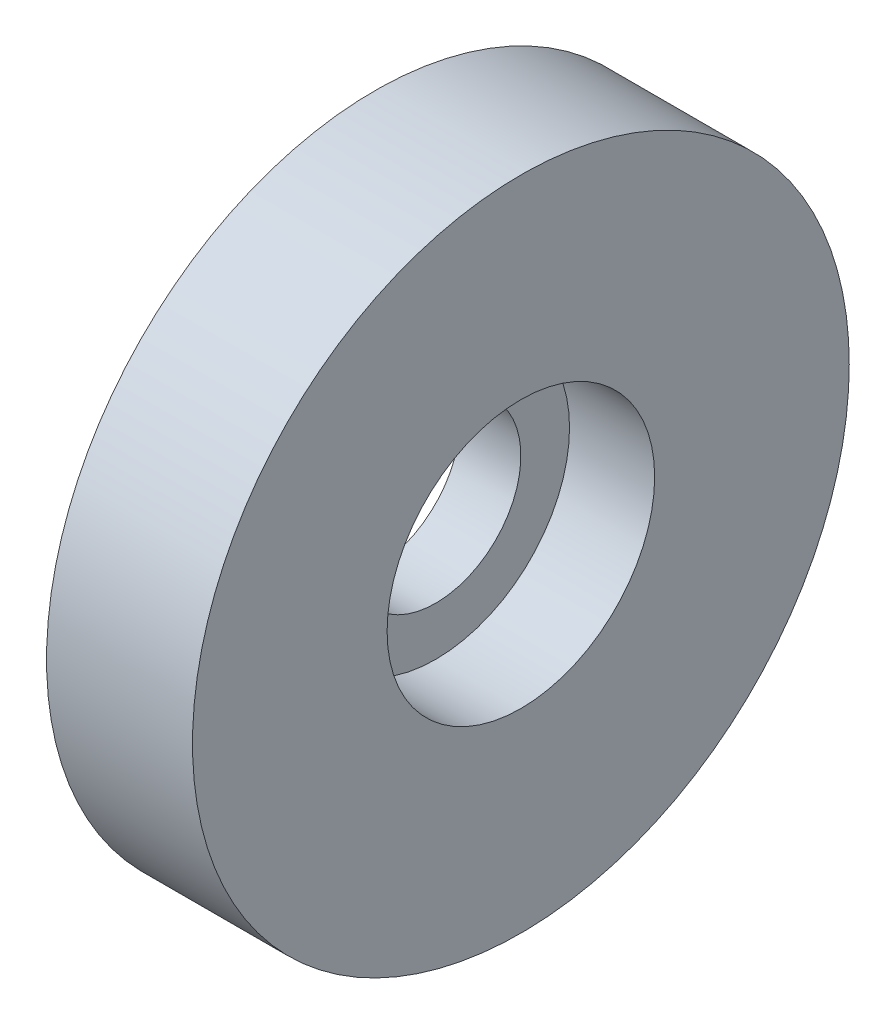
ISO-10303-21;
HEADER;
FILE_DESCRIPTION(('STEP AP214'),'2;1');
FILE_NAME('part.step','',(''),(''),'','','');
FILE_SCHEMA(('AUTOMOTIVE_DESIGN { 1 0 10303 214 1 1 1 1 }'));
ENDSEC;
DATA;
#1=APPLICATION_CONTEXT('core data for automotive mechanical design processes');
#2=APPLICATION_PROTOCOL_DEFINITION('international standard','automotive_design',2000,#1);
#3=PRODUCT_CONTEXT('',#1,'mechanical');
#4=PRODUCT('Part','Part','',(#3));
#5=PRODUCT_RELATED_PRODUCT_CATEGORY('part','',(#4));
#6=PRODUCT_DEFINITION_FORMATION('','',#4);
#7=PRODUCT_DEFINITION_CONTEXT('part definition',#1,'design');
#8=PRODUCT_DEFINITION('design','',#6,#7);
#9=PRODUCT_DEFINITION_SHAPE('','',#8);
#10=(LENGTH_UNIT() NAMED_UNIT(*) SI_UNIT(.MILLI.,.METRE.));
#11=(NAMED_UNIT(*) PLANE_ANGLE_UNIT() SI_UNIT($,.RADIAN.));
#12=(NAMED_UNIT(*) SI_UNIT($,.STERADIAN.) SOLID_ANGLE_UNIT());
#13=UNCERTAINTY_MEASURE_WITH_UNIT(LENGTH_MEASURE(1.E-05),#10,'distance_accuracy_value','');
#14=(GEOMETRIC_REPRESENTATION_CONTEXT(3) GLOBAL_UNCERTAINTY_ASSIGNED_CONTEXT((#13)) GLOBAL_UNIT_ASSIGNED_CONTEXT((#10,
#11,#12)) REPRESENTATION_CONTEXT('',''));
#15=CARTESIAN_POINT('',(0.,0.,0.));
#16=DIRECTION('',(0.,0.,1.));
#17=DIRECTION('',(1.,0.,0.));
#18=AXIS2_PLACEMENT_3D('',#15,#16,#17);
#19=CARTESIAN_POINT('',(0.,7.,0.));
#20=DIRECTION('',(-1.,0.,0.));
#21=DIRECTION('',(0.,0.,1.));
#22=AXIS2_PLACEMENT_3D('',#19,#20,#21);
#23=CYLINDRICAL_SURFACE('',#22,27.);
#24=CARTESIAN_POINT('',(0.,7.,0.));
#25=DIRECTION('',(1.,0.,0.));
#26=DIRECTION('',(0.,0.,-1.));
#27=AXIS2_PLACEMENT_3D('',#24,#25,#26);
#28=CIRCLE('',#27,27.);
#29=CARTESIAN_POINT('',(0.,7.,-27.));
#30=VERTEX_POINT('',#29);
#31=EDGE_CURVE('E47',#30,#30,#28,.F.);
#32=ORIENTED_EDGE('',*,*,#31,.F.);
#33=EDGE_LOOP('',(#32));
#34=FACE_BOUND('',#33,.T.);
#35=CARTESIAN_POINT('',(12.,7.,0.));
#36=DIRECTION('',(1.,0.,0.));
#37=DIRECTION('',(0.,0.,-1.));
#38=AXIS2_PLACEMENT_3D('',#35,#36,#37);
#39=CIRCLE('',#38,27.);
#40=CARTESIAN_POINT('',(12.,7.,-27.));
#41=VERTEX_POINT('',#40);
#42=EDGE_CURVE('E60',#41,#41,#39,.F.);
#43=ORIENTED_EDGE('',*,*,#42,.T.);
#44=EDGE_LOOP('',(#43));
#45=FACE_BOUND('',#44,.T.);
#46=ADVANCED_FACE('F43',(#34,#45),#23,.T.);
#47=CARTESIAN_POINT('',(5.,0.,0.));
#48=DIRECTION('',(1.,0.,0.));
#49=DIRECTION('',(0.,0.,-1.));
#50=AXIS2_PLACEMENT_3D('',#47,#48,#49);
#51=PLANE('',#50);
#52=CARTESIAN_POINT('',(5.,7.,0.));
#53=DIRECTION('',(-1.,0.,0.));
#54=DIRECTION('',(0.,0.,1.));
#55=AXIS2_PLACEMENT_3D('',#52,#53,#54);
#56=CIRCLE('',#55,7.);
#57=CARTESIAN_POINT('',(5.,7.,7.));
#58=VERTEX_POINT('',#57);
#59=EDGE_CURVE('E57',#58,#58,#56,.T.);
#60=ORIENTED_EDGE('',*,*,#59,.T.);
#61=EDGE_LOOP('',(#60));
#62=FACE_BOUND('',#61,.T.);
#63=CARTESIAN_POINT('',(5.,7.,0.));
#64=DIRECTION('',(-1.,0.,0.));
#65=DIRECTION('',(0.,0.,1.));
#66=AXIS2_PLACEMENT_3D('',#63,#64,#65);
#67=CIRCLE('',#66,11.);
#68=CARTESIAN_POINT('',(5.,7.,11.));
#69=VERTEX_POINT('',#68);
#70=EDGE_CURVE('E61',#69,#69,#67,.T.);
#71=ORIENTED_EDGE('',*,*,#70,.F.);
#72=EDGE_LOOP('',(#71));
#73=FACE_BOUND('',#72,.T.);
#74=ADVANCED_FACE('F45',(#62,#73),#51,.T.);
#75=CARTESIAN_POINT('',(0.,7.,0.));
#76=DIRECTION('',(-1.,0.,0.));
#77=DIRECTION('',(0.,0.,1.));
#78=AXIS2_PLACEMENT_3D('',#75,#76,#77);
#79=CYLINDRICAL_SURFACE('',#78,7.);
#80=CARTESIAN_POINT('',(0.,7.,0.));
#81=DIRECTION('',(1.,0.,0.));
#82=DIRECTION('',(0.,0.,-1.));
#83=AXIS2_PLACEMENT_3D('',#80,#81,#82);
#84=CIRCLE('',#83,7.);
#85=CARTESIAN_POINT('',(0.,7.,-7.));
#86=VERTEX_POINT('',#85);
#87=EDGE_CURVE('E11',#86,#86,#84,.T.);
#88=ORIENTED_EDGE('',*,*,#87,.F.);
#89=EDGE_LOOP('',(#88));
#90=FACE_BOUND('',#89,.T.);
#91=ORIENTED_EDGE('',*,*,#59,.F.);
#92=EDGE_LOOP('',(#91));
#93=FACE_BOUND('',#92,.T.);
#94=ADVANCED_FACE('F74',(#90,#93),#79,.F.);
#95=CARTESIAN_POINT('',(0.,7.,0.));
#96=DIRECTION('',(-1.,0.,0.));
#97=DIRECTION('',(0.,0.,1.));
#98=AXIS2_PLACEMENT_3D('',#95,#96,#97);
#99=CYLINDRICAL_SURFACE('',#98,11.);
#100=ORIENTED_EDGE('',*,*,#70,.T.);
#101=EDGE_LOOP('',(#100));
#102=FACE_BOUND('',#101,.T.);
#103=CARTESIAN_POINT('',(12.,7.,0.));
#104=DIRECTION('',(-1.,0.,0.));
#105=DIRECTION('',(0.,0.,1.));
#106=AXIS2_PLACEMENT_3D('',#103,#104,#105);
#107=CIRCLE('',#106,11.);
#108=CARTESIAN_POINT('',(12.,7.,11.));
#109=VERTEX_POINT('',#108);
#110=EDGE_CURVE('E65',#109,#109,#107,.T.);
#111=ORIENTED_EDGE('',*,*,#110,.F.);
#112=EDGE_LOOP('',(#111));
#113=FACE_BOUND('',#112,.T.);
#114=ADVANCED_FACE('F76',(#102,#113),#99,.F.);
#115=CARTESIAN_POINT('',(0.,0.,0.));
#116=DIRECTION('',(1.,0.,0.));
#117=DIRECTION('',(0.,0.,-1.));
#118=AXIS2_PLACEMENT_3D('',#115,#116,#117);
#119=PLANE('',#118);
#120=ORIENTED_EDGE('',*,*,#87,.T.);
#121=EDGE_LOOP('',(#120));
#122=FACE_BOUND('',#121,.T.);
#123=ORIENTED_EDGE('',*,*,#31,.T.);
#124=EDGE_LOOP('',(#123));
#125=FACE_BOUND('',#124,.T.);
#126=ADVANCED_FACE('F82',(#122,#125),#119,.F.);
#127=CARTESIAN_POINT('',(12.,0.,0.));
#128=DIRECTION('',(1.,0.,0.));
#129=DIRECTION('',(0.,0.,-1.));
#130=AXIS2_PLACEMENT_3D('',#127,#128,#129);
#131=PLANE('',#130);
#132=ORIENTED_EDGE('',*,*,#42,.F.);
#133=EDGE_LOOP('',(#132));
#134=FACE_BOUND('',#133,.T.);
#135=ORIENTED_EDGE('',*,*,#110,.T.);
#136=EDGE_LOOP('',(#135));
#137=FACE_BOUND('',#136,.T.);
#138=ADVANCED_FACE('F95',(#134,#137),#131,.T.);
#139=CLOSED_SHELL('',(#46,#74,#94,#114,#126,#138));
#140=MANIFOLD_SOLID_BREP('B2',#139);
#141=ADVANCED_BREP_SHAPE_REPRESENTATION('',(#18,#140),#14);
#142=SHAPE_DEFINITION_REPRESENTATION(#9,#141);
ENDSEC;
END-ISO-10303-21;
